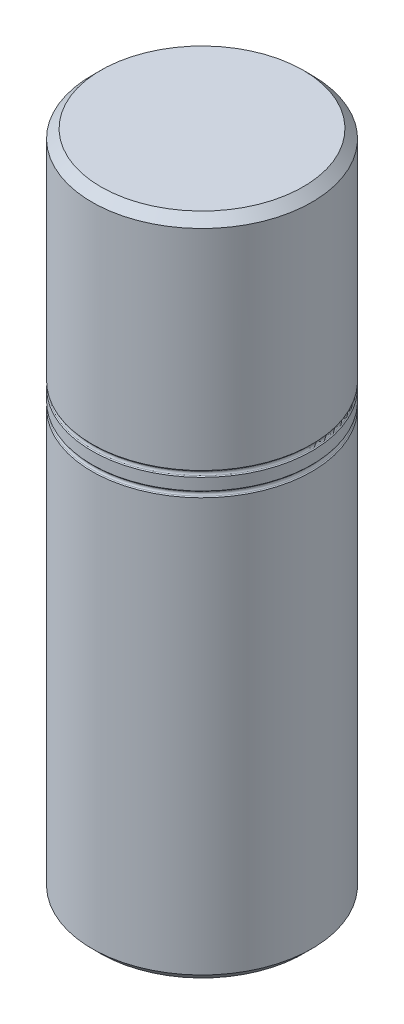
ISO-10303-21;
HEADER;
FILE_DESCRIPTION(('STEP AP214'),'2;1');
FILE_NAME('part.step','',(''),(''),'','','');
FILE_SCHEMA(('AUTOMOTIVE_DESIGN { 1 0 10303 214 1 1 1 1 }'));
ENDSEC;
DATA;
#1=APPLICATION_CONTEXT('core data for automotive mechanical design processes');
#2=APPLICATION_PROTOCOL_DEFINITION('international standard','automotive_design',2000,#1);
#3=PRODUCT_CONTEXT('',#1,'mechanical');
#4=PRODUCT('Part','Part','',(#3));
#5=PRODUCT_RELATED_PRODUCT_CATEGORY('part','',(#4));
#6=PRODUCT_DEFINITION_FORMATION('','',#4);
#7=PRODUCT_DEFINITION_CONTEXT('part definition',#1,'design');
#8=PRODUCT_DEFINITION('design','',#6,#7);
#9=PRODUCT_DEFINITION_SHAPE('','',#8);
#10=(LENGTH_UNIT() NAMED_UNIT(*) SI_UNIT(.MILLI.,.METRE.));
#11=(NAMED_UNIT(*) PLANE_ANGLE_UNIT() SI_UNIT($,.RADIAN.));
#12=(NAMED_UNIT(*) SI_UNIT($,.STERADIAN.) SOLID_ANGLE_UNIT());
#13=UNCERTAINTY_MEASURE_WITH_UNIT(LENGTH_MEASURE(1.E-05),#10,'distance_accuracy_value','');
#14=(GEOMETRIC_REPRESENTATION_CONTEXT(3) GLOBAL_UNCERTAINTY_ASSIGNED_CONTEXT((#13)) GLOBAL_UNIT_ASSIGNED_CONTEXT((#10,
#11,#12)) REPRESENTATION_CONTEXT('',''));
#15=CARTESIAN_POINT('',(0.,0.,0.));
#16=DIRECTION('',(0.,0.,1.));
#17=DIRECTION('',(1.,0.,0.));
#18=AXIS2_PLACEMENT_3D('',#15,#16,#17);
#19=CARTESIAN_POINT('',(0.,0.,0.));
#20=DIRECTION('',(0.,-1.,0.));
#21=DIRECTION('',(0.,0.,-1.));
#22=AXIS2_PLACEMENT_3D('',#19,#20,#21);
#23=CYLINDRICAL_SURFACE('',#22,9.4615);
#24=CARTESIAN_POINT('',(0.,37.846,0.));
#25=DIRECTION('',(0.,-1.,0.));
#26=DIRECTION('',(0.,0.,-1.));
#27=AXIS2_PLACEMENT_3D('',#24,#25,#26);
#28=CIRCLE('',#27,9.4615);
#29=CARTESIAN_POINT('',(0.,37.846,-9.4615));
#30=VERTEX_POINT('',#29);
#31=EDGE_CURVE('E34',#30,#30,#28,.F.);
#32=ORIENTED_EDGE('',*,*,#31,.F.);
#33=EDGE_LOOP('',(#32));
#34=FACE_BOUND('',#33,.T.);
#35=CARTESIAN_POINT('',(0.,36.83,0.));
#36=DIRECTION('',(0.,1.,0.));
#37=DIRECTION('',(0.,0.,1.));
#38=AXIS2_PLACEMENT_3D('',#35,#36,#37);
#39=CIRCLE('',#38,9.4615);
#40=CARTESIAN_POINT('',(0.,36.83,9.4615));
#41=VERTEX_POINT('',#40);
#42=EDGE_CURVE('E47',#41,#41,#39,.F.);
#43=ORIENTED_EDGE('',*,*,#42,.F.);
#44=EDGE_LOOP('',(#43));
#45=FACE_BOUND('',#44,.T.);
#46=ADVANCED_FACE('F30',(#34,#45),#23,.T.);
#47=CARTESIAN_POINT('',(0.,36.322,0.));
#48=DIRECTION('',(0.,-1.,0.));
#49=DIRECTION('',(0.,0.,-1.));
#50=AXIS2_PLACEMENT_3D('',#47,#48,#49);
#51=CIRCLE('',#50,9.4615);
#52=CARTESIAN_POINT('',(0.,36.322,-9.4615));
#53=VERTEX_POINT('',#52);
#54=EDGE_CURVE('E50',#53,#53,#51,.F.);
#55=ORIENTED_EDGE('',*,*,#54,.F.);
#56=EDGE_LOOP('',(#55));
#57=FACE_BOUND('',#56,.T.);
#58=CARTESIAN_POINT('',(0.,0.762,0.));
#59=DIRECTION('',(0.,-1.,0.));
#60=DIRECTION('',(0.,0.,-1.));
#61=AXIS2_PLACEMENT_3D('',#58,#59,#60);
#62=CIRCLE('',#61,9.4615);
#63=CARTESIAN_POINT('',(0.,0.762,-9.4615));
#64=VERTEX_POINT('',#63);
#65=EDGE_CURVE('E43',#64,#64,#62,.T.);
#66=ORIENTED_EDGE('',*,*,#65,.F.);
#67=EDGE_LOOP('',(#66));
#68=FACE_BOUND('',#67,.T.);
#69=ADVANCED_FACE('F89',(#57,#68),#23,.T.);
#70=CARTESIAN_POINT('',(0.,0.,0.));
#71=DIRECTION('',(0.,-1.,0.));
#72=DIRECTION('',(0.,0.,-1.));
#73=AXIS2_PLACEMENT_3D('',#70,#71,#72);
#74=CYLINDRICAL_SURFACE('',#73,4.8006);
#75=CARTESIAN_POINT('',(0.,0.,0.));
#76=DIRECTION('',(0.,-1.,0.));
#77=DIRECTION('',(0.,0.,-1.));
#78=AXIS2_PLACEMENT_3D('',#75,#76,#77);
#79=CIRCLE('',#78,4.8006);
#80=CARTESIAN_POINT('',(0.,0.,-4.8006));
#81=VERTEX_POINT('',#80);
#82=EDGE_CURVE('E10',#81,#81,#79,.T.);
#83=ORIENTED_EDGE('',*,*,#82,.T.);
#84=EDGE_LOOP('',(#83));
#85=FACE_BOUND('',#84,.T.);
#86=CARTESIAN_POINT('',(0.,2.032,0.));
#87=DIRECTION('',(0.,-1.,0.));
#88=DIRECTION('',(0.,0.,-1.));
#89=AXIS2_PLACEMENT_3D('',#86,#87,#88);
#90=CIRCLE('',#89,4.8006);
#91=CARTESIAN_POINT('',(0.,2.032,-4.8006));
#92=VERTEX_POINT('',#91);
#93=EDGE_CURVE('E53',#92,#92,#90,.T.);
#94=ORIENTED_EDGE('',*,*,#93,.F.);
#95=EDGE_LOOP('',(#94));
#96=FACE_BOUND('',#95,.T.);
#97=ADVANCED_FACE('F32',(#85,#96),#74,.F.);
#98=CARTESIAN_POINT('',(8.6995,0.,0.));
#99=DIRECTION('',(0.,-1.,0.));
#100=DIRECTION('',(0.,0.,-1.));
#101=AXIS2_PLACEMENT_3D('',#98,#99,#100);
#102=PLANE('',#101);
#103=CARTESIAN_POINT('',(0.,0.,0.));
#104=DIRECTION('',(0.,-1.,0.));
#105=DIRECTION('',(0.,0.,-1.));
#106=AXIS2_PLACEMENT_3D('',#103,#104,#105);
#107=CIRCLE('',#106,8.6995);
#108=CARTESIAN_POINT('',(0.,0.,-8.6995));
#109=VERTEX_POINT('',#108);
#110=EDGE_CURVE('E38',#109,#109,#107,.T.);
#111=ORIENTED_EDGE('',*,*,#110,.T.);
#112=EDGE_LOOP('',(#111));
#113=FACE_BOUND('',#112,.T.);
#114=ORIENTED_EDGE('',*,*,#82,.F.);
#115=EDGE_LOOP('',(#114));
#116=FACE_BOUND('',#115,.T.);
#117=ADVANCED_FACE('F98',(#113,#116),#102,.T.);
#118=CARTESIAN_POINT('',(0.,0.,0.));
#119=DIRECTION('',(0.,1.,0.));
#120=DIRECTION('',(0.,0.,1.));
#121=AXIS2_PLACEMENT_3D('',#118,#119,#120);
#122=CONICAL_SURFACE('',#121,8.6995,0.785398163397449);
#123=ORIENTED_EDGE('',*,*,#65,.T.);
#124=EDGE_LOOP('',(#123));
#125=FACE_BOUND('',#124,.T.);
#126=ORIENTED_EDGE('',*,*,#110,.F.);
#127=EDGE_LOOP('',(#126));
#128=FACE_BOUND('',#127,.T.);
#129=ADVANCED_FACE('F86',(#125,#128),#122,.T.);
#130=CARTESIAN_POINT('',(4.5466,2.286,0.));
#131=DIRECTION('',(0.,-1.,0.));
#132=DIRECTION('',(0.,0.,-1.));
#133=AXIS2_PLACEMENT_3D('',#130,#131,#132);
#134=PLANE('',#133);
#135=CARTESIAN_POINT('',(0.,2.286,0.));
#136=DIRECTION('',(0.,-1.,0.));
#137=DIRECTION('',(0.,0.,-1.));
#138=AXIS2_PLACEMENT_3D('',#135,#136,#137);
#139=CIRCLE('',#138,4.5466);
#140=CARTESIAN_POINT('',(0.,2.286,-4.5466));
#141=VERTEX_POINT('',#140);
#142=EDGE_CURVE('E75',#141,#141,#139,.T.);
#143=ORIENTED_EDGE('',*,*,#142,.T.);
#144=EDGE_LOOP('',(#143));
#145=FACE_BOUND('',#144,.T.);
#146=ADVANCED_FACE('F121',(#145),#134,.T.);
#147=CARTESIAN_POINT('',(0.,2.286,0.));
#148=DIRECTION('',(0.,-1.,0.));
#149=DIRECTION('',(0.,0.,-1.));
#150=AXIS2_PLACEMENT_3D('',#147,#148,#149);
#151=CONICAL_SURFACE('',#150,4.5466,0.785398163397448);
#152=ORIENTED_EDGE('',*,*,#93,.T.);
#153=EDGE_LOOP('',(#152));
#154=FACE_BOUND('',#153,.T.);
#155=ORIENTED_EDGE('',*,*,#142,.F.);
#156=EDGE_LOOP('',(#155));
#157=FACE_BOUND('',#156,.T.);
#158=ADVANCED_FACE('F124',(#154,#157),#151,.F.);
#159=CARTESIAN_POINT('',(0.,36.3963948775786,0.));
#160=DIRECTION('',(0.,-1.,0.));
#161=DIRECTION('',(0.,0.,-1.));
#162=AXIS2_PLACEMENT_3D('',#159,#160,#161);
#163=CONICAL_SURFACE('',#162,9.38710512242139,0.785398163397448);
#164=ORIENTED_EDGE('',*,*,#54,.T.);
#165=EDGE_LOOP('',(#164));
#166=FACE_BOUND('',#165,.T.);
#167=CARTESIAN_POINT('',(0.,36.3963948775786,0.));
#168=DIRECTION('',(0.,-1.,0.));
#169=DIRECTION('',(0.,0.,-1.));
#170=AXIS2_PLACEMENT_3D('',#167,#168,#169);
#171=CIRCLE('',#170,9.38710512242139);
#172=CARTESIAN_POINT('',(0.,36.3963948775786,-9.38710512242139));
#173=VERTEX_POINT('',#172);
#174=EDGE_CURVE('E60',#173,#173,#171,.T.);
#175=ORIENTED_EDGE('',*,*,#174,.T.);
#176=EDGE_LOOP('',(#175));
#177=FACE_BOUND('',#176,.T.);
#178=ADVANCED_FACE('F128',(#166,#177),#163,.T.);
#179=CARTESIAN_POINT('',(0.,36.8935,0.));
#180=DIRECTION('',(0.,1.,0.));
#181=DIRECTION('',(0.,0.,1.));
#182=AXIS2_PLACEMENT_3D('',#179,#180,#181);
#183=CONICAL_SURFACE('',#182,9.525,0.785398163397448);
#184=ORIENTED_EDGE('',*,*,#42,.T.);
#185=EDGE_LOOP('',(#184));
#186=FACE_BOUND('',#185,.T.);
#187=CARTESIAN_POINT('',(0.,36.7556051224214,0.));
#188=DIRECTION('',(0.,-1.,0.));
#189=DIRECTION('',(0.,0.,-1.));
#190=AXIS2_PLACEMENT_3D('',#187,#188,#189);
#191=CIRCLE('',#190,9.38710512242139);
#192=CARTESIAN_POINT('',(0.,36.7556051224214,-9.38710512242139));
#193=VERTEX_POINT('',#192);
#194=EDGE_CURVE('E51',#193,#193,#191,.T.);
#195=ORIENTED_EDGE('',*,*,#194,.F.);
#196=EDGE_LOOP('',(#195));
#197=FACE_BOUND('',#196,.T.);
#198=ADVANCED_FACE('F132',(#186,#197),#183,.T.);
#199=CARTESIAN_POINT('',(0.,36.576,0.));
#200=DIRECTION('',(0.,-1.,0.));
#201=DIRECTION('',(0.,0.,-1.));
#202=AXIS2_PLACEMENT_3D('',#199,#200,#201);
#203=TOROIDAL_SURFACE('',#202,9.56671024484277,0.254000000000003);
#204=ORIENTED_EDGE('',*,*,#174,.F.);
#205=EDGE_LOOP('',(#204));
#206=FACE_BOUND('',#205,.T.);
#207=ORIENTED_EDGE('',*,*,#194,.T.);
#208=EDGE_LOOP('',(#207));
#209=FACE_BOUND('',#208,.T.);
#210=ADVANCED_FACE('F136',(#206,#209),#203,.F.);
#211=CARTESIAN_POINT('',(0.,37.9203948775786,0.));
#212=DIRECTION('',(0.,-1.,0.));
#213=DIRECTION('',(0.,0.,-1.));
#214=AXIS2_PLACEMENT_3D('',#211,#212,#213);
#215=CONICAL_SURFACE('',#214,9.38710512242139,0.785398163397448);
#216=ORIENTED_EDGE('',*,*,#31,.T.);
#217=EDGE_LOOP('',(#216));
#218=FACE_BOUND('',#217,.T.);
#219=CARTESIAN_POINT('',(0.,37.9203948775786,0.));
#220=DIRECTION('',(0.,-1.,0.));
#221=DIRECTION('',(0.,0.,-1.));
#222=AXIS2_PLACEMENT_3D('',#219,#220,#221);
#223=CIRCLE('',#222,9.38710512242139);
#224=CARTESIAN_POINT('',(0.,37.9203948775786,-9.38710512242139));
#225=VERTEX_POINT('',#224);
#226=EDGE_CURVE('E62',#225,#225,#223,.T.);
#227=ORIENTED_EDGE('',*,*,#226,.T.);
#228=EDGE_LOOP('',(#227));
#229=FACE_BOUND('',#228,.T.);
#230=ADVANCED_FACE('F140',(#218,#229),#215,.T.);
#231=CARTESIAN_POINT('',(0.,38.4175,0.));
#232=DIRECTION('',(0.,1.,0.));
#233=DIRECTION('',(0.,0.,1.));
#234=AXIS2_PLACEMENT_3D('',#231,#232,#233);
#235=CONICAL_SURFACE('',#234,9.525,0.785398163397448);
#236=CARTESIAN_POINT('',(0.,38.354,0.));
#237=DIRECTION('',(0.,1.,0.));
#238=DIRECTION('',(0.,0.,1.));
#239=AXIS2_PLACEMENT_3D('',#236,#237,#238);
#240=CIRCLE('',#239,9.4615);
#241=CARTESIAN_POINT('',(0.,38.354,9.4615));
#242=VERTEX_POINT('',#241);
#243=EDGE_CURVE('E54',#242,#242,#240,.F.);
#244=ORIENTED_EDGE('',*,*,#243,.T.);
#245=EDGE_LOOP('',(#244));
#246=FACE_BOUND('',#245,.T.);
#247=CARTESIAN_POINT('',(0.,38.2796051224214,0.));
#248=DIRECTION('',(0.,-1.,0.));
#249=DIRECTION('',(0.,0.,-1.));
#250=AXIS2_PLACEMENT_3D('',#247,#248,#249);
#251=CIRCLE('',#250,9.38710512242139);
#252=CARTESIAN_POINT('',(0.,38.2796051224214,-9.38710512242139));
#253=VERTEX_POINT('',#252);
#254=EDGE_CURVE('E56',#253,#253,#251,.T.);
#255=ORIENTED_EDGE('',*,*,#254,.F.);
#256=EDGE_LOOP('',(#255));
#257=FACE_BOUND('',#256,.T.);
#258=ADVANCED_FACE('F144',(#246,#257),#235,.T.);
#259=CARTESIAN_POINT('',(0.,38.1,0.));
#260=DIRECTION('',(0.,-1.,0.));
#261=DIRECTION('',(0.,0.,-1.));
#262=AXIS2_PLACEMENT_3D('',#259,#260,#261);
#263=TOROIDAL_SURFACE('',#262,9.56671024484277,0.254000000000003);
#264=ORIENTED_EDGE('',*,*,#226,.F.);
#265=EDGE_LOOP('',(#264));
#266=FACE_BOUND('',#265,.T.);
#267=ORIENTED_EDGE('',*,*,#254,.T.);
#268=EDGE_LOOP('',(#267));
#269=FACE_BOUND('',#268,.T.);
#270=ADVANCED_FACE('F117',(#266,#269),#263,.F.);
#271=CARTESIAN_POINT('',(8.6995,57.15,0.));
#272=DIRECTION('',(0.,1.,0.));
#273=DIRECTION('',(0.,0.,1.));
#274=AXIS2_PLACEMENT_3D('',#271,#272,#273);
#275=PLANE('',#274);
#276=CARTESIAN_POINT('',(0.,57.15,0.));
#277=DIRECTION('',(0.,-1.,0.));
#278=DIRECTION('',(0.,0.,-1.));
#279=AXIS2_PLACEMENT_3D('',#276,#277,#278);
#280=CIRCLE('',#279,8.6995);
#281=CARTESIAN_POINT('',(0.,57.15,-8.6995));
#282=VERTEX_POINT('',#281);
#283=EDGE_CURVE('E78',#282,#282,#280,.T.);
#284=ORIENTED_EDGE('',*,*,#283,.F.);
#285=EDGE_LOOP('',(#284));
#286=FACE_BOUND('',#285,.T.);
#287=ADVANCED_FACE('F109',(#286),#275,.T.);
#288=CARTESIAN_POINT('',(0.,56.388,0.));
#289=DIRECTION('',(0.,-1.,0.));
#290=DIRECTION('',(0.,0.,-1.));
#291=AXIS2_PLACEMENT_3D('',#288,#289,#290);
#292=CONICAL_SURFACE('',#291,9.4615,0.78539816339745);
#293=ORIENTED_EDGE('',*,*,#283,.T.);
#294=EDGE_LOOP('',(#293));
#295=FACE_BOUND('',#294,.T.);
#296=CARTESIAN_POINT('',(0.,56.388,0.));
#297=DIRECTION('',(0.,-1.,0.));
#298=DIRECTION('',(0.,0.,-1.));
#299=AXIS2_PLACEMENT_3D('',#296,#297,#298);
#300=CIRCLE('',#299,9.4615);
#301=CARTESIAN_POINT('',(0.,56.388,-9.4615));
#302=VERTEX_POINT('',#301);
#303=EDGE_CURVE('E81',#302,#302,#300,.T.);
#304=ORIENTED_EDGE('',*,*,#303,.F.);
#305=EDGE_LOOP('',(#304));
#306=FACE_BOUND('',#305,.T.);
#307=ADVANCED_FACE('F104',(#295,#306),#292,.T.);
#308=ORIENTED_EDGE('',*,*,#243,.F.);
#309=EDGE_LOOP('',(#308));
#310=FACE_BOUND('',#309,.T.);
#311=ORIENTED_EDGE('',*,*,#303,.T.);
#312=EDGE_LOOP('',(#311));
#313=FACE_BOUND('',#312,.T.);
#314=ADVANCED_FACE('F93',(#310,#313),#23,.T.);
#315=CLOSED_SHELL('',(#46,#69,#97,#117,#129,#146,#158,#178,#198,#210,#230,#258,#270,#287,#307,#314));
#316=MANIFOLD_SOLID_BREP('B2',#315);
#317=ADVANCED_BREP_SHAPE_REPRESENTATION('',(#18,#316),#14);
#318=SHAPE_DEFINITION_REPRESENTATION(#9,#317);
ENDSEC;
END-ISO-10303-21;
